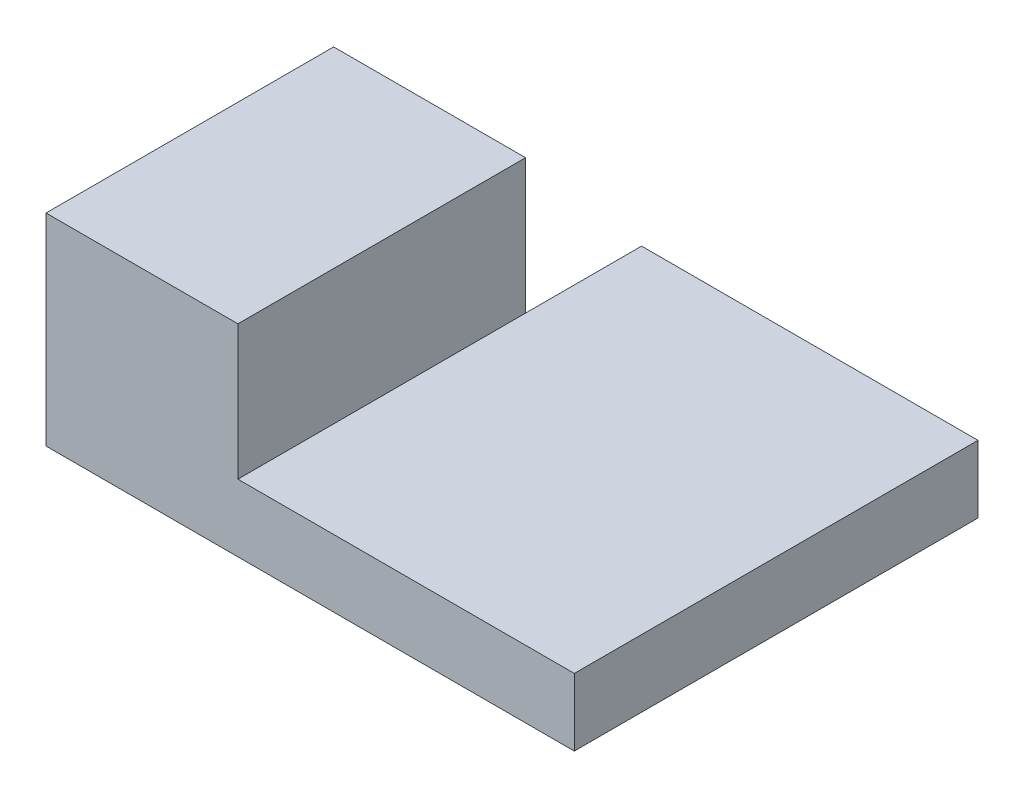
ISO-10303-21;
HEADER;
FILE_DESCRIPTION(('STEP AP214'),'2;1');
FILE_NAME('part.step','',(''),(''),'','','');
FILE_SCHEMA(('AUTOMOTIVE_DESIGN { 1 0 10303 214 1 1 1 1 }'));
ENDSEC;
DATA;
#1=APPLICATION_CONTEXT('core data for automotive mechanical design processes');
#2=APPLICATION_PROTOCOL_DEFINITION('international standard','automotive_design',2000,#1);
#3=PRODUCT_CONTEXT('',#1,'mechanical');
#4=PRODUCT('Part','Part','',(#3));
#5=PRODUCT_RELATED_PRODUCT_CATEGORY('part','',(#4));
#6=PRODUCT_DEFINITION_FORMATION('','',#4);
#7=PRODUCT_DEFINITION_CONTEXT('part definition',#1,'design');
#8=PRODUCT_DEFINITION('design','',#6,#7);
#9=PRODUCT_DEFINITION_SHAPE('','',#8);
#10=(LENGTH_UNIT() NAMED_UNIT(*) SI_UNIT(.MILLI.,.METRE.));
#11=(NAMED_UNIT(*) PLANE_ANGLE_UNIT() SI_UNIT($,.RADIAN.));
#12=(NAMED_UNIT(*) SI_UNIT($,.STERADIAN.) SOLID_ANGLE_UNIT());
#13=UNCERTAINTY_MEASURE_WITH_UNIT(LENGTH_MEASURE(1.E-05),#10,'distance_accuracy_value','');
#14=(GEOMETRIC_REPRESENTATION_CONTEXT(3) GLOBAL_UNCERTAINTY_ASSIGNED_CONTEXT((#13)) GLOBAL_UNIT_ASSIGNED_CONTEXT((#10,
#11,#12)) REPRESENTATION_CONTEXT('',''));
#15=CARTESIAN_POINT('',(0.,0.,0.));
#16=DIRECTION('',(0.,0.,1.));
#17=DIRECTION('',(1.,0.,0.));
#18=AXIS2_PLACEMENT_3D('',#15,#16,#17);
#19=CARTESIAN_POINT('',(-24.9999999999999,10.,0.));
#20=DIRECTION('',(1.,0.,0.));
#21=DIRECTION('',(0.,0.,-1.));
#22=AXIS2_PLACEMENT_3D('',#19,#20,#21);
#23=PLANE('',#22);
#24=DIRECTION('',(0.,-1.,0.));
#25=VECTOR('',#24,1.);
#26=CARTESIAN_POINT('',(-24.9999999999999,30.,-12.75460812292));
#27=LINE('',#26,#25);
#28=CARTESIAN_POINT('',(-24.9999999999999,10.,-12.75460812292));
#29=VERTEX_POINT('',#28);
#30=CARTESIAN_POINT('',(-24.9999999999999,0.,-12.75460812292));
#31=VERTEX_POINT('',#30);
#32=EDGE_CURVE('E11',#29,#31,#27,.T.);
#33=ORIENTED_EDGE('',*,*,#32,.F.);
#34=DIRECTION('',(0.,0.,1.));
#35=VECTOR('',#34,1.);
#36=CARTESIAN_POINT('',(-24.9999999999999,10.,0.));
#37=LINE('',#36,#35);
#38=CARTESIAN_POINT('',(-24.9999999999999,10.,-29.9999999999997));
#39=VERTEX_POINT('',#38);
#40=EDGE_CURVE('E145',#39,#29,#37,.T.);
#41=ORIENTED_EDGE('',*,*,#40,.F.);
#42=DIRECTION('',(0.,-1.,0.));
#43=VECTOR('',#42,1.);
#44=CARTESIAN_POINT('',(-24.9999999999999,10.,-29.9999999999997));
#45=LINE('',#44,#43);
#46=CARTESIAN_POINT('',(-24.9999999999999,0.,-29.9999999999997));
#47=VERTEX_POINT('',#46);
#48=EDGE_CURVE('E153',#39,#47,#45,.T.);
#49=ORIENTED_EDGE('',*,*,#48,.T.);
#50=DIRECTION('',(0.,0.,1.));
#51=VECTOR('',#50,1.);
#52=CARTESIAN_POINT('',(-24.9999999999999,0.,0.));
#53=LINE('',#52,#51);
#54=EDGE_CURVE('E150',#47,#31,#53,.T.);
#55=ORIENTED_EDGE('',*,*,#54,.T.);
#56=EDGE_LOOP('',(#33,#41,#49,#55));
#57=FACE_BOUND('',#56,.T.);
#58=ADVANCED_FACE('F33',(#57),#23,.F.);
#59=CARTESIAN_POINT('',(24.9999999999999,10.,0.));
#60=DIRECTION('',(1.,0.,0.));
#61=DIRECTION('',(0.,0.,-1.));
#62=AXIS2_PLACEMENT_3D('',#59,#60,#61);
#63=PLANE('',#62);
#64=DIRECTION('',(0.,0.,1.));
#65=VECTOR('',#64,1.);
#66=CARTESIAN_POINT('',(24.9999999999999,0.,0.));
#67=LINE('',#66,#65);
#68=CARTESIAN_POINT('',(24.9999999999999,0.,-29.9999999999997));
#69=VERTEX_POINT('',#68);
#70=CARTESIAN_POINT('',(24.9999999999999,0.,29.9999999999999));
#71=VERTEX_POINT('',#70);
#72=EDGE_CURVE('E129',#69,#71,#67,.T.);
#73=ORIENTED_EDGE('',*,*,#72,.F.);
#74=DIRECTION('',(0.,-1.,0.));
#75=VECTOR('',#74,1.);
#76=CARTESIAN_POINT('',(24.9999999999999,10.,-29.9999999999997));
#77=LINE('',#76,#75);
#78=CARTESIAN_POINT('',(24.9999999999999,10.,-29.9999999999997));
#79=VERTEX_POINT('',#78);
#80=EDGE_CURVE('E37',#79,#69,#77,.T.);
#81=ORIENTED_EDGE('',*,*,#80,.F.);
#82=DIRECTION('',(0.,0.,1.));
#83=VECTOR('',#82,1.);
#84=CARTESIAN_POINT('',(24.9999999999999,10.,0.));
#85=LINE('',#84,#83);
#86=CARTESIAN_POINT('',(24.9999999999999,10.,29.9999999999999));
#87=VERTEX_POINT('',#86);
#88=EDGE_CURVE('E138',#79,#87,#85,.T.);
#89=ORIENTED_EDGE('',*,*,#88,.T.);
#90=DIRECTION('',(0.,-1.,0.));
#91=VECTOR('',#90,1.);
#92=CARTESIAN_POINT('',(24.9999999999999,10.,29.9999999999999));
#93=LINE('',#92,#91);
#94=EDGE_CURVE('E75',#87,#71,#93,.T.);
#95=ORIENTED_EDGE('',*,*,#94,.T.);
#96=EDGE_LOOP('',(#73,#81,#89,#95));
#97=FACE_BOUND('',#96,.T.);
#98=ADVANCED_FACE('F35',(#97),#63,.T.);
#99=CARTESIAN_POINT('',(0.,10.,-29.9999999999997));
#100=DIRECTION('',(0.,0.,-1.));
#101=DIRECTION('',(-1.,0.,0.));
#102=AXIS2_PLACEMENT_3D('',#99,#100,#101);
#103=PLANE('',#102);
#104=DIRECTION('',(1.,0.,0.));
#105=VECTOR('',#104,1.);
#106=CARTESIAN_POINT('',(0.,0.,-29.9999999999997));
#107=LINE('',#106,#105);
#108=EDGE_CURVE('E132',#47,#69,#107,.T.);
#109=ORIENTED_EDGE('',*,*,#108,.F.);
#110=ORIENTED_EDGE('',*,*,#48,.F.);
#111=DIRECTION('',(1.,0.,0.));
#112=VECTOR('',#111,1.);
#113=CARTESIAN_POINT('',(0.,10.,-29.9999999999997));
#114=LINE('',#113,#112);
#115=EDGE_CURVE('E140',#39,#79,#114,.T.);
#116=ORIENTED_EDGE('',*,*,#115,.T.);
#117=ORIENTED_EDGE('',*,*,#80,.T.);
#118=EDGE_LOOP('',(#109,#110,#116,#117));
#119=FACE_BOUND('',#118,.T.);
#120=ADVANCED_FACE('F157',(#119),#103,.T.);
#121=CARTESIAN_POINT('',(0.,10.,29.9999999999999));
#122=DIRECTION('',(0.,0.,-1.));
#123=DIRECTION('',(-1.,0.,0.));
#124=AXIS2_PLACEMENT_3D('',#121,#122,#123);
#125=PLANE('',#124);
#126=DIRECTION('',(1.,0.,0.));
#127=VECTOR('',#126,1.);
#128=CARTESIAN_POINT('',(0.,0.,29.9999999999999));
#129=LINE('',#128,#127);
#130=CARTESIAN_POINT('',(-53.5220655623872,0.,29.9999999999999));
#131=VERTEX_POINT('',#130);
#132=EDGE_CURVE('E141',#131,#71,#129,.T.);
#133=ORIENTED_EDGE('',*,*,#132,.T.);
#134=ORIENTED_EDGE('',*,*,#94,.F.);
#135=DIRECTION('',(1.,0.,0.));
#136=VECTOR('',#135,1.);
#137=CARTESIAN_POINT('',(0.,10.,29.9999999999999));
#138=LINE('',#137,#136);
#139=CARTESIAN_POINT('',(-24.9999999999999,10.,29.9999999999999));
#140=VERTEX_POINT('',#139);
#141=EDGE_CURVE('E57',#140,#87,#138,.T.);
#142=ORIENTED_EDGE('',*,*,#141,.F.);
#143=DIRECTION('',(0.,-1.,0.));
#144=VECTOR('',#143,1.);
#145=CARTESIAN_POINT('',(-24.9999999999999,30.,29.9999999999999));
#146=LINE('',#145,#144);
#147=CARTESIAN_POINT('',(-24.9999999999999,30.,29.9999999999999));
#148=VERTEX_POINT('',#147);
#149=EDGE_CURVE('E134',#148,#140,#146,.T.);
#150=ORIENTED_EDGE('',*,*,#149,.F.);
#151=DIRECTION('',(-1.,0.,0.));
#152=VECTOR('',#151,1.);
#153=CARTESIAN_POINT('',(0.,30.,29.9999999999999));
#154=LINE('',#153,#152);
#155=CARTESIAN_POINT('',(-53.5220655623872,30.,29.9999999999999));
#156=VERTEX_POINT('',#155);
#157=EDGE_CURVE('E114',#148,#156,#154,.T.);
#158=ORIENTED_EDGE('',*,*,#157,.T.);
#159=DIRECTION('',(0.,-1.,0.));
#160=VECTOR('',#159,1.);
#161=CARTESIAN_POINT('',(-53.5220655623872,30.,29.9999999999999));
#162=LINE('',#161,#160);
#163=EDGE_CURVE('E110',#156,#131,#162,.T.);
#164=ORIENTED_EDGE('',*,*,#163,.T.);
#165=EDGE_LOOP('',(#133,#134,#142,#150,#158,#164));
#166=FACE_BOUND('',#165,.T.);
#167=ADVANCED_FACE('F169',(#166),#125,.F.);
#168=CARTESIAN_POINT('',(0.,10.,0.));
#169=DIRECTION('',(0.,1.,0.));
#170=DIRECTION('',(0.,0.,1.));
#171=AXIS2_PLACEMENT_3D('',#168,#169,#170);
#172=PLANE('',#171);
#173=ORIENTED_EDGE('',*,*,#88,.F.);
#174=ORIENTED_EDGE('',*,*,#115,.F.);
#175=ORIENTED_EDGE('',*,*,#40,.T.);
#176=EDGE_CURVE('E144',#29,#140,#37,.T.);
#177=ORIENTED_EDGE('',*,*,#176,.T.);
#178=ORIENTED_EDGE('',*,*,#141,.T.);
#179=EDGE_LOOP('',(#173,#174,#175,#177,#178));
#180=FACE_BOUND('',#179,.T.);
#181=ADVANCED_FACE('F171',(#180),#172,.T.);
#182=CARTESIAN_POINT('',(0.,0.,0.));
#183=DIRECTION('',(0.,1.,0.));
#184=DIRECTION('',(0.,0.,1.));
#185=AXIS2_PLACEMENT_3D('',#182,#183,#184);
#186=PLANE('',#185);
#187=ORIENTED_EDGE('',*,*,#72,.T.);
#188=ORIENTED_EDGE('',*,*,#132,.F.);
#189=DIRECTION('',(0.,0.,1.));
#190=VECTOR('',#189,1.);
#191=CARTESIAN_POINT('',(-53.5220655623872,0.,0.));
#192=LINE('',#191,#190);
#193=CARTESIAN_POINT('',(-53.5220655623872,0.,-12.75460812292));
#194=VERTEX_POINT('',#193);
#195=EDGE_CURVE('E124',#194,#131,#192,.T.);
#196=ORIENTED_EDGE('',*,*,#195,.F.);
#197=DIRECTION('',(-1.,0.,0.));
#198=VECTOR('',#197,1.);
#199=CARTESIAN_POINT('',(0.,0.,-12.75460812292));
#200=LINE('',#199,#198);
#201=EDGE_CURVE('E128',#31,#194,#200,.T.);
#202=ORIENTED_EDGE('',*,*,#201,.F.);
#203=ORIENTED_EDGE('',*,*,#54,.F.);
#204=ORIENTED_EDGE('',*,*,#108,.T.);
#205=EDGE_LOOP('',(#187,#188,#196,#202,#203,#204));
#206=FACE_BOUND('',#205,.T.);
#207=ADVANCED_FACE('F160',(#206),#186,.F.);
#208=CARTESIAN_POINT('',(-24.9999999999999,30.,0.));
#209=DIRECTION('',(1.,0.,0.));
#210=DIRECTION('',(0.,0.,-1.));
#211=AXIS2_PLACEMENT_3D('',#208,#209,#210);
#212=PLANE('',#211);
#213=ORIENTED_EDGE('',*,*,#176,.F.);
#214=CARTESIAN_POINT('',(-24.9999999999999,30.,-12.75460812292));
#215=VERTEX_POINT('',#214);
#216=EDGE_CURVE('E43',#215,#29,#27,.T.);
#217=ORIENTED_EDGE('',*,*,#216,.F.);
#218=DIRECTION('',(0.,0.,1.));
#219=VECTOR('',#218,1.);
#220=CARTESIAN_POINT('',(-24.9999999999999,30.,0.));
#221=LINE('',#220,#219);
#222=EDGE_CURVE('E121',#215,#148,#221,.T.);
#223=ORIENTED_EDGE('',*,*,#222,.T.);
#224=ORIENTED_EDGE('',*,*,#149,.T.);
#225=EDGE_LOOP('',(#213,#217,#223,#224));
#226=FACE_BOUND('',#225,.T.);
#227=ADVANCED_FACE('F170',(#226),#212,.T.);
#228=CARTESIAN_POINT('',(0.,30.,-12.75460812292));
#229=DIRECTION('',(0.,0.,1.));
#230=DIRECTION('',(1.,0.,0.));
#231=AXIS2_PLACEMENT_3D('',#228,#229,#230);
#232=PLANE('',#231);
#233=ORIENTED_EDGE('',*,*,#201,.T.);
#234=DIRECTION('',(0.,-1.,0.));
#235=VECTOR('',#234,1.);
#236=CARTESIAN_POINT('',(-53.5220655623872,30.,-12.75460812292));
#237=LINE('',#236,#235);
#238=CARTESIAN_POINT('',(-53.5220655623872,30.,-12.75460812292));
#239=VERTEX_POINT('',#238);
#240=EDGE_CURVE('E107',#239,#194,#237,.T.);
#241=ORIENTED_EDGE('',*,*,#240,.F.);
#242=DIRECTION('',(-1.,0.,0.));
#243=VECTOR('',#242,1.);
#244=CARTESIAN_POINT('',(0.,30.,-12.75460812292));
#245=LINE('',#244,#243);
#246=EDGE_CURVE('E115',#215,#239,#245,.T.);
#247=ORIENTED_EDGE('',*,*,#246,.F.);
#248=ORIENTED_EDGE('',*,*,#216,.T.);
#249=ORIENTED_EDGE('',*,*,#32,.T.);
#250=EDGE_LOOP('',(#233,#241,#247,#248,#249));
#251=FACE_BOUND('',#250,.T.);
#252=ADVANCED_FACE('F126',(#251),#232,.F.);
#253=CARTESIAN_POINT('',(-53.5220655623872,30.,0.));
#254=DIRECTION('',(1.,0.,0.));
#255=DIRECTION('',(0.,0.,-1.));
#256=AXIS2_PLACEMENT_3D('',#253,#254,#255);
#257=PLANE('',#256);
#258=ORIENTED_EDGE('',*,*,#195,.T.);
#259=ORIENTED_EDGE('',*,*,#163,.F.);
#260=DIRECTION('',(0.,0.,1.));
#261=VECTOR('',#260,1.);
#262=CARTESIAN_POINT('',(-53.5220655623872,30.,0.));
#263=LINE('',#262,#261);
#264=EDGE_CURVE('E102',#239,#156,#263,.T.);
#265=ORIENTED_EDGE('',*,*,#264,.F.);
#266=ORIENTED_EDGE('',*,*,#240,.T.);
#267=EDGE_LOOP('',(#258,#259,#265,#266));
#268=FACE_BOUND('',#267,.T.);
#269=ADVANCED_FACE('F105',(#268),#257,.F.);
#270=CARTESIAN_POINT('',(0.,30.,0.));
#271=DIRECTION('',(0.,1.,0.));
#272=DIRECTION('',(0.,0.,1.));
#273=AXIS2_PLACEMENT_3D('',#270,#271,#272);
#274=PLANE('',#273);
#275=ORIENTED_EDGE('',*,*,#246,.T.);
#276=ORIENTED_EDGE('',*,*,#264,.T.);
#277=ORIENTED_EDGE('',*,*,#157,.F.);
#278=ORIENTED_EDGE('',*,*,#222,.F.);
#279=EDGE_LOOP('',(#275,#276,#277,#278));
#280=FACE_BOUND('',#279,.T.);
#281=ADVANCED_FACE('F119',(#280),#274,.T.);
#282=CLOSED_SHELL('',(#58,#98,#120,#167,#181,#207,#227,#252,#269,#281));
#283=MANIFOLD_SOLID_BREP('B2',#282);
#284=ADVANCED_BREP_SHAPE_REPRESENTATION('',(#18,#283),#14);
#285=SHAPE_DEFINITION_REPRESENTATION(#9,#284);
ENDSEC;
END-ISO-10303-21;
